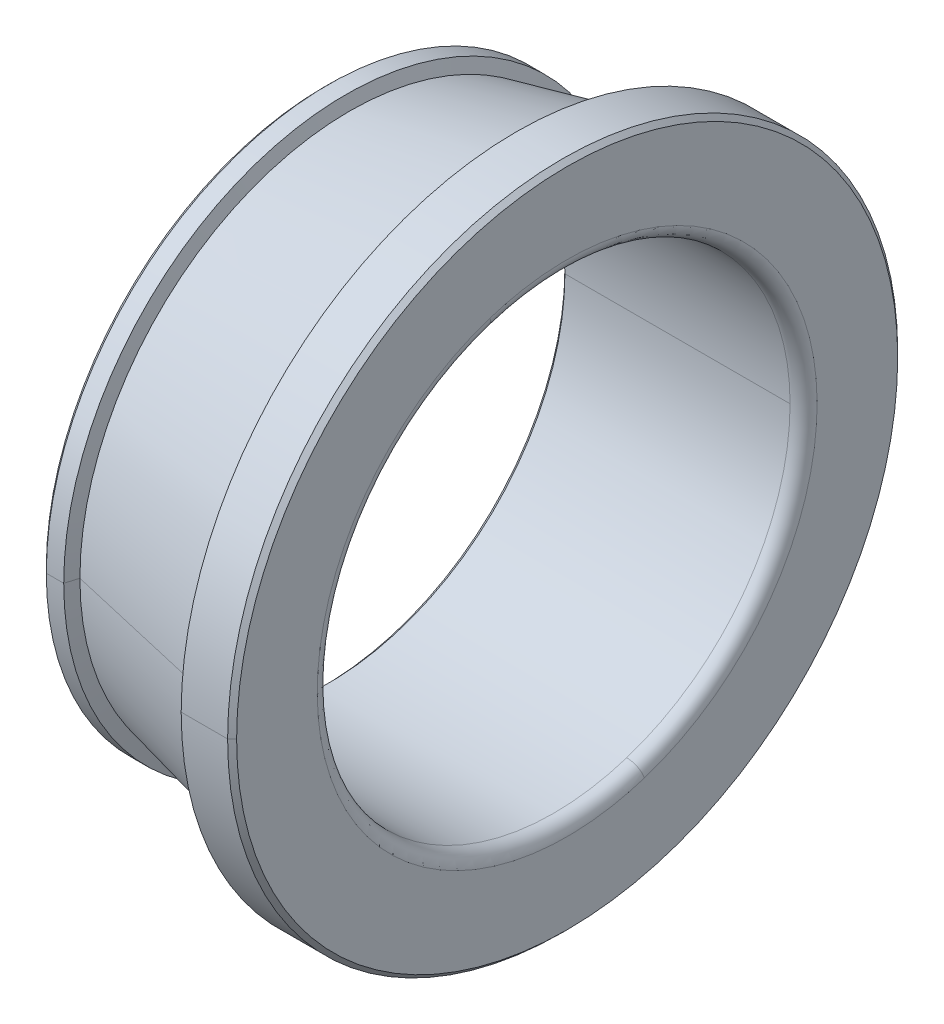
ISO-10303-21;
HEADER;
FILE_DESCRIPTION(('STEP AP214'),'2;1');
FILE_NAME('part.step','',(''),(''),'','','');
FILE_SCHEMA(('AUTOMOTIVE_DESIGN { 1 0 10303 214 1 1 1 1 }'));
ENDSEC;
DATA;
#1=APPLICATION_CONTEXT('core data for automotive mechanical design processes');
#2=APPLICATION_PROTOCOL_DEFINITION('international standard','automotive_design',2000,#1);
#3=PRODUCT_CONTEXT('',#1,'mechanical');
#4=PRODUCT('Part','Part','',(#3));
#5=PRODUCT_RELATED_PRODUCT_CATEGORY('part','',(#4));
#6=PRODUCT_DEFINITION_FORMATION('','',#4);
#7=PRODUCT_DEFINITION_CONTEXT('part definition',#1,'design');
#8=PRODUCT_DEFINITION('design','',#6,#7);
#9=PRODUCT_DEFINITION_SHAPE('','',#8);
#10=(LENGTH_UNIT() NAMED_UNIT(*) SI_UNIT(.MILLI.,.METRE.));
#11=(NAMED_UNIT(*) PLANE_ANGLE_UNIT() SI_UNIT($,.RADIAN.));
#12=(NAMED_UNIT(*) SI_UNIT($,.STERADIAN.) SOLID_ANGLE_UNIT());
#13=UNCERTAINTY_MEASURE_WITH_UNIT(LENGTH_MEASURE(1.E-05),#10,'distance_accuracy_value','');
#14=(GEOMETRIC_REPRESENTATION_CONTEXT(3) GLOBAL_UNCERTAINTY_ASSIGNED_CONTEXT((#13)) GLOBAL_UNIT_ASSIGNED_CONTEXT((#10,
#11,#12)) REPRESENTATION_CONTEXT('',''));
#15=CARTESIAN_POINT('',(0.,0.,0.));
#16=DIRECTION('',(0.,0.,1.));
#17=DIRECTION('',(1.,0.,0.));
#18=AXIS2_PLACEMENT_3D('',#15,#16,#17);
#19=CARTESIAN_POINT('',(0.,20.554666666667,0.));
#20=DIRECTION('',(-1.,0.,0.));
#21=DIRECTION('',(0.,0.,1.));
#22=AXIS2_PLACEMENT_3D('',#19,#20,#21);
#23=PLANE('',#22);
#24=CARTESIAN_POINT('',(0.,0.,0.));
#25=DIRECTION('',(1.,0.,0.));
#26=DIRECTION('',(0.,0.,-1.));
#27=AXIS2_PLACEMENT_3D('',#24,#25,#26);
#28=CIRCLE('',#27,17.833333333333);
#29=CARTESIAN_POINT('',(0.,0.,-17.833333333333));
#30=VERTEX_POINT('',#29);
#31=CARTESIAN_POINT('',(0.,0.,17.833333333333));
#32=VERTEX_POINT('',#31);
#33=EDGE_CURVE('E11',#30,#32,#28,.T.);
#34=ORIENTED_EDGE('',*,*,#33,.T.);
#35=CARTESIAN_POINT('',(0.,0.,0.));
#36=DIRECTION('',(1.,0.,0.));
#37=DIRECTION('',(0.,0.,-1.));
#38=AXIS2_PLACEMENT_3D('',#35,#36,#37);
#39=CIRCLE('',#38,17.833333333333);
#40=EDGE_CURVE('E25',#32,#30,#39,.T.);
#41=ORIENTED_EDGE('',*,*,#40,.T.);
#42=EDGE_LOOP('',(#34,#41));
#43=FACE_BOUND('',#42,.T.);
#44=CARTESIAN_POINT('',(0.,0.,0.));
#45=DIRECTION('',(1.,0.,0.));
#46=DIRECTION('',(0.,0.,-1.));
#47=AXIS2_PLACEMENT_3D('',#44,#45,#46);
#48=CIRCLE('',#47,20.554666666667);
#49=CARTESIAN_POINT('',(0.,0.,20.554666666667));
#50=VERTEX_POINT('',#49);
#51=CARTESIAN_POINT('',(0.,0.,-20.554666666667));
#52=VERTEX_POINT('',#51);
#53=EDGE_CURVE('E371',#50,#52,#48,.T.);
#54=ORIENTED_EDGE('',*,*,#53,.F.);
#55=CARTESIAN_POINT('',(0.,0.,0.));
#56=DIRECTION('',(1.,0.,0.));
#57=DIRECTION('',(0.,0.,-1.));
#58=AXIS2_PLACEMENT_3D('',#55,#56,#57);
#59=CIRCLE('',#58,20.554666666667);
#60=EDGE_CURVE('E366',#52,#50,#59,.T.);
#61=ORIENTED_EDGE('',*,*,#60,.F.);
#62=EDGE_LOOP('',(#54,#61));
#63=FACE_BOUND('',#62,.T.);
#64=ADVANCED_FACE('F17',(#43,#63),#23,.T.);
#65=CARTESIAN_POINT('',(0.333333333333331,0.,0.));
#66=DIRECTION('',(1.,0.,0.));
#67=DIRECTION('',(0.,-1.,0.));
#68=AXIS2_PLACEMENT_3D('',#65,#66,#67);
#69=CONICAL_SURFACE('',#68,20.888,0.785398163396954);
#70=DIRECTION('',(0.707106781186898,0.,0.707106781186197));
#71=VECTOR('',#70,1.);
#72=CARTESIAN_POINT('',(0.,0.,20.554666666667));
#73=LINE('',#72,#71);
#74=CARTESIAN_POINT('',(0.333333333333332,0.,20.888));
#75=VERTEX_POINT('',#74);
#76=EDGE_CURVE('E362',#50,#75,#73,.T.);
#77=ORIENTED_EDGE('',*,*,#76,.T.);
#78=CARTESIAN_POINT('',(0.333333333333331,0.,0.));
#79=DIRECTION('',(1.,0.,0.));
#80=DIRECTION('',(0.,0.,-1.));
#81=AXIS2_PLACEMENT_3D('',#78,#79,#80);
#82=CIRCLE('',#81,20.888);
#83=CARTESIAN_POINT('',(0.333333333333331,0.,-20.888));
#84=VERTEX_POINT('',#83);
#85=EDGE_CURVE('E357',#84,#75,#82,.T.);
#86=ORIENTED_EDGE('',*,*,#85,.F.);
#87=DIRECTION('',(0.707106781186898,0.,-0.707106781186197));
#88=VECTOR('',#87,1.);
#89=CARTESIAN_POINT('',(0.,0.,-20.554666666667));
#90=LINE('',#89,#88);
#91=EDGE_CURVE('E352',#52,#84,#90,.T.);
#92=ORIENTED_EDGE('',*,*,#91,.F.);
#93=ORIENTED_EDGE('',*,*,#60,.T.);
#94=EDGE_LOOP('',(#77,#86,#92,#93));
#95=FACE_BOUND('',#94,.T.);
#96=ADVANCED_FACE('F387',(#95),#69,.T.);
#97=CARTESIAN_POINT('',(0.333333333333331,0.,0.));
#98=DIRECTION('',(1.,0.,0.));
#99=DIRECTION('',(0.,1.,0.));
#100=AXIS2_PLACEMENT_3D('',#97,#98,#99);
#101=CONICAL_SURFACE('',#100,20.888,0.785398163396954);
#102=ORIENTED_EDGE('',*,*,#76,.F.);
#103=ORIENTED_EDGE('',*,*,#53,.T.);
#104=ORIENTED_EDGE('',*,*,#91,.T.);
#105=CARTESIAN_POINT('',(0.333333333333331,0.,0.));
#106=DIRECTION('',(1.,0.,0.));
#107=DIRECTION('',(0.,0.,-1.));
#108=AXIS2_PLACEMENT_3D('',#105,#106,#107);
#109=CIRCLE('',#108,20.888);
#110=EDGE_CURVE('E347',#75,#84,#109,.T.);
#111=ORIENTED_EDGE('',*,*,#110,.F.);
#112=EDGE_LOOP('',(#102,#103,#104,#111));
#113=FACE_BOUND('',#112,.T.);
#114=ADVANCED_FACE('F382',(#113),#101,.T.);
#115=CARTESIAN_POINT('',(18.,0.,0.));
#116=DIRECTION('',(1.,0.,0.));
#117=DIRECTION('',(0.,1.,-2.44532342362417E-13));
#118=AXIS2_PLACEMENT_3D('',#115,#116,#117);
#119=CYLINDRICAL_SURFACE('',#118,20.888);
#120=DIRECTION('',(1.,0.,0.));
#121=VECTOR('',#120,1.);
#122=CARTESIAN_POINT('',(0.333333333333332,0.,20.888));
#123=LINE('',#122,#121);
#124=CARTESIAN_POINT('',(1.6227811681402,0.,20.888));
#125=VERTEX_POINT('',#124);
#126=EDGE_CURVE('E342',#75,#125,#123,.T.);
#127=ORIENTED_EDGE('',*,*,#126,.F.);
#128=ORIENTED_EDGE('',*,*,#110,.T.);
#129=DIRECTION('',(1.,0.,0.));
#130=VECTOR('',#129,1.);
#131=CARTESIAN_POINT('',(0.333333333333332,0.,-20.888));
#132=LINE('',#131,#130);
#133=CARTESIAN_POINT('',(1.6227811681402,0.,-20.888));
#134=VERTEX_POINT('',#133);
#135=EDGE_CURVE('E338',#84,#134,#132,.T.);
#136=ORIENTED_EDGE('',*,*,#135,.T.);
#137=CARTESIAN_POINT('',(1.6227811681402,0.,0.));
#138=DIRECTION('',(1.,0.,0.));
#139=DIRECTION('',(0.,0.,-1.));
#140=AXIS2_PLACEMENT_3D('',#137,#138,#139);
#141=CIRCLE('',#140,20.888);
#142=EDGE_CURVE('E333',#125,#134,#141,.T.);
#143=ORIENTED_EDGE('',*,*,#142,.F.);
#144=EDGE_LOOP('',(#127,#128,#136,#143));
#145=FACE_BOUND('',#144,.T.);
#146=ADVANCED_FACE('F394',(#145),#119,.T.);
#147=CARTESIAN_POINT('',(1.9011701674844,0.,0.));
#148=DIRECTION('',(-1.,0.,0.));
#149=DIRECTION('',(0.,1.,0.));
#150=AXIS2_PLACEMENT_3D('',#147,#148,#149);
#151=CONICAL_SURFACE('',#150,19.967846835473,1.27700505380672);
#152=DIRECTION('',(-0.289583125422376,0.,-0.957152868391778));
#153=VECTOR('',#152,1.);
#154=CARTESIAN_POINT('',(1.9011701674844,0.,-19.967846835473));
#155=LINE('',#154,#153);
#156=CARTESIAN_POINT('',(1.9011701674844,0.,-19.967846835473));
#157=VERTEX_POINT('',#156);
#158=EDGE_CURVE('E328',#157,#134,#155,.T.);
#159=ORIENTED_EDGE('',*,*,#158,.F.);
#160=CARTESIAN_POINT('',(1.9011701674844,0.,0.));
#161=DIRECTION('',(1.,0.,0.));
#162=DIRECTION('',(0.,0.,-1.));
#163=AXIS2_PLACEMENT_3D('',#160,#161,#162);
#164=CIRCLE('',#163,19.967846835473);
#165=CARTESIAN_POINT('',(1.9011701674844,0.,19.967846835473));
#166=VERTEX_POINT('',#165);
#167=EDGE_CURVE('E323',#166,#157,#164,.T.);
#168=ORIENTED_EDGE('',*,*,#167,.F.);
#169=DIRECTION('',(-0.289583125422376,0.,0.957152868391778));
#170=VECTOR('',#169,1.);
#171=CARTESIAN_POINT('',(1.9011701674844,0.,19.967846835473));
#172=LINE('',#171,#170);
#173=EDGE_CURVE('E318',#166,#125,#172,.T.);
#174=ORIENTED_EDGE('',*,*,#173,.T.);
#175=ORIENTED_EDGE('',*,*,#142,.T.);
#176=EDGE_LOOP('',(#159,#168,#174,#175));
#177=FACE_BOUND('',#176,.T.);
#178=ADVANCED_FACE('F396',(#177),#151,.T.);
#179=CARTESIAN_POINT('',(1.9011701674844,0.,0.));
#180=DIRECTION('',(-1.,0.,0.));
#181=DIRECTION('',(0.,-1.,0.));
#182=AXIS2_PLACEMENT_3D('',#179,#180,#181);
#183=CONICAL_SURFACE('',#182,19.967846835473,1.27700505380672);
#184=ORIENTED_EDGE('',*,*,#158,.T.);
#185=CARTESIAN_POINT('',(1.6227811681402,0.,0.));
#186=DIRECTION('',(1.,0.,0.));
#187=DIRECTION('',(0.,0.,-1.));
#188=AXIS2_PLACEMENT_3D('',#185,#186,#187);
#189=CIRCLE('',#188,20.888);
#190=EDGE_CURVE('E313',#134,#125,#189,.T.);
#191=ORIENTED_EDGE('',*,*,#190,.T.);
#192=ORIENTED_EDGE('',*,*,#173,.F.);
#193=CARTESIAN_POINT('',(1.9011701674844,0.,0.));
#194=DIRECTION('',(1.,0.,0.));
#195=DIRECTION('',(0.,0.,-1.));
#196=AXIS2_PLACEMENT_3D('',#193,#194,#195);
#197=CIRCLE('',#196,19.967846835473);
#198=EDGE_CURVE('E308',#157,#166,#197,.T.);
#199=ORIENTED_EDGE('',*,*,#198,.F.);
#200=EDGE_LOOP('',(#184,#191,#192,#199));
#201=FACE_BOUND('',#200,.T.);
#202=ADVANCED_FACE('F401',(#201),#183,.T.);
#203=CARTESIAN_POINT('',(14.791689415647,0.,0.));
#204=DIRECTION('',(1.,0.,0.));
#205=DIRECTION('',(0.,-1.,0.));
#206=AXIS2_PLACEMENT_3D('',#203,#204,#205);
#207=CONICAL_SURFACE('',#206,22.943857696966,0.226892802759296);
#208=DIRECTION('',(0.974370064785228,0.,0.224951054343897));
#209=VECTOR('',#208,1.);
#210=CARTESIAN_POINT('',(1.9011701674844,0.,19.967846835473));
#211=LINE('',#210,#209);
#212=CARTESIAN_POINT('',(14.791689415647,0.,22.943857696966));
#213=VERTEX_POINT('',#212);
#214=EDGE_CURVE('E304',#166,#213,#211,.T.);
#215=ORIENTED_EDGE('',*,*,#214,.T.);
#216=CARTESIAN_POINT('',(14.791689415647,0.,0.));
#217=DIRECTION('',(1.,0.,0.));
#218=DIRECTION('',(0.,0.,-1.));
#219=AXIS2_PLACEMENT_3D('',#216,#217,#218);
#220=CIRCLE('',#219,22.943857696966);
#221=CARTESIAN_POINT('',(14.791689415647,0.,-22.943857696966));
#222=VERTEX_POINT('',#221);
#223=EDGE_CURVE('E299',#222,#213,#220,.T.);
#224=ORIENTED_EDGE('',*,*,#223,.F.);
#225=DIRECTION('',(0.974370064785228,0.,-0.224951054343897));
#226=VECTOR('',#225,1.);
#227=CARTESIAN_POINT('',(1.9011701674844,0.,-19.967846835473));
#228=LINE('',#227,#226);
#229=EDGE_CURVE('E294',#157,#222,#228,.T.);
#230=ORIENTED_EDGE('',*,*,#229,.F.);
#231=ORIENTED_EDGE('',*,*,#198,.T.);
#232=EDGE_LOOP('',(#215,#224,#230,#231));
#233=FACE_BOUND('',#232,.T.);
#234=ADVANCED_FACE('F408',(#233),#207,.T.);
#235=CARTESIAN_POINT('',(14.791689415647,0.,0.));
#236=DIRECTION('',(1.,0.,0.));
#237=DIRECTION('',(0.,1.,0.));
#238=AXIS2_PLACEMENT_3D('',#235,#236,#237);
#239=CONICAL_SURFACE('',#238,22.943857696966,0.226892802759296);
#240=ORIENTED_EDGE('',*,*,#214,.F.);
#241=ORIENTED_EDGE('',*,*,#167,.T.);
#242=ORIENTED_EDGE('',*,*,#229,.T.);
#243=CARTESIAN_POINT('',(14.791689415647,0.,0.));
#244=DIRECTION('',(1.,0.,0.));
#245=DIRECTION('',(0.,0.,-1.));
#246=AXIS2_PLACEMENT_3D('',#243,#244,#245);
#247=CIRCLE('',#246,22.943857696966);
#248=EDGE_CURVE('E289',#213,#222,#247,.T.);
#249=ORIENTED_EDGE('',*,*,#248,.F.);
#250=EDGE_LOOP('',(#240,#241,#242,#249));
#251=FACE_BOUND('',#250,.T.);
#252=ADVANCED_FACE('F405',(#251),#239,.T.);
#253=CARTESIAN_POINT('',(14.230120300523,0.,0.));
#254=DIRECTION('',(-1.,0.,0.));
#255=DIRECTION('',(0.,1.,0.));
#256=AXIS2_PLACEMENT_3D('',#253,#254,#255);
#257=CONICAL_SURFACE('',#256,24.8,1.27700505380678);
#258=DIRECTION('',(-0.289583125422325,0.,-0.957152868391793));
#259=VECTOR('',#258,1.);
#260=CARTESIAN_POINT('',(14.791689415647,0.,-22.943857696966));
#261=LINE('',#260,#259);
#262=CARTESIAN_POINT('',(14.230120300523,0.,-24.8));
#263=VERTEX_POINT('',#262);
#264=EDGE_CURVE('E285',#222,#263,#261,.T.);
#265=ORIENTED_EDGE('',*,*,#264,.T.);
#266=CARTESIAN_POINT('',(14.230120300523,0.,0.));
#267=DIRECTION('',(1.,0.,0.));
#268=DIRECTION('',(0.,0.,-1.));
#269=AXIS2_PLACEMENT_3D('',#266,#267,#268);
#270=CIRCLE('',#269,24.8);
#271=CARTESIAN_POINT('',(14.230120300523,0.,24.8));
#272=VERTEX_POINT('',#271);
#273=EDGE_CURVE('E280',#272,#263,#270,.T.);
#274=ORIENTED_EDGE('',*,*,#273,.F.);
#275=DIRECTION('',(-0.289583125422325,0.,0.957152868391794));
#276=VECTOR('',#275,1.);
#277=CARTESIAN_POINT('',(14.791689415647,0.,22.943857696966));
#278=LINE('',#277,#276);
#279=EDGE_CURVE('E275',#213,#272,#278,.T.);
#280=ORIENTED_EDGE('',*,*,#279,.F.);
#281=ORIENTED_EDGE('',*,*,#248,.T.);
#282=EDGE_LOOP('',(#265,#274,#280,#281));
#283=FACE_BOUND('',#282,.T.);
#284=ADVANCED_FACE('F410',(#283),#257,.F.);
#285=CARTESIAN_POINT('',(14.230120300523,0.,0.));
#286=DIRECTION('',(-1.,0.,0.));
#287=DIRECTION('',(0.,-1.,0.));
#288=AXIS2_PLACEMENT_3D('',#285,#286,#287);
#289=CONICAL_SURFACE('',#288,24.8,1.27700505380678);
#290=ORIENTED_EDGE('',*,*,#264,.F.);
#291=ORIENTED_EDGE('',*,*,#223,.T.);
#292=ORIENTED_EDGE('',*,*,#279,.T.);
#293=CARTESIAN_POINT('',(14.230120300523,0.,0.));
#294=DIRECTION('',(1.,0.,0.));
#295=DIRECTION('',(0.,0.,-1.));
#296=AXIS2_PLACEMENT_3D('',#293,#294,#295);
#297=CIRCLE('',#296,24.8);
#298=EDGE_CURVE('E270',#263,#272,#297,.T.);
#299=ORIENTED_EDGE('',*,*,#298,.F.);
#300=EDGE_LOOP('',(#290,#291,#292,#299));
#301=FACE_BOUND('',#300,.T.);
#302=ADVANCED_FACE('F415',(#301),#289,.F.);
#303=CARTESIAN_POINT('',(18.,0.,0.));
#304=DIRECTION('',(1.,0.,0.));
#305=DIRECTION('',(0.,-1.,-1.13526025456648E-13));
#306=AXIS2_PLACEMENT_3D('',#303,#304,#305);
#307=CYLINDRICAL_SURFACE('',#306,24.8);
#308=DIRECTION('',(1.,0.,0.));
#309=VECTOR('',#308,1.);
#310=CARTESIAN_POINT('',(14.230120300523,0.,24.8));
#311=LINE('',#310,#309);
#312=CARTESIAN_POINT('',(17.666666666667,0.,24.8));
#313=VERTEX_POINT('',#312);
#314=EDGE_CURVE('E266',#272,#313,#311,.T.);
#315=ORIENTED_EDGE('',*,*,#314,.T.);
#316=CARTESIAN_POINT('',(17.666666666667,0.,0.));
#317=DIRECTION('',(1.,0.,0.));
#318=DIRECTION('',(0.,0.,-1.));
#319=AXIS2_PLACEMENT_3D('',#316,#317,#318);
#320=CIRCLE('',#319,24.8);
#321=CARTESIAN_POINT('',(17.666666666667,0.,-24.8));
#322=VERTEX_POINT('',#321);
#323=EDGE_CURVE('E261',#322,#313,#320,.T.);
#324=ORIENTED_EDGE('',*,*,#323,.F.);
#325=DIRECTION('',(1.,0.,0.));
#326=VECTOR('',#325,1.);
#327=CARTESIAN_POINT('',(14.230120300523,0.,-24.8));
#328=LINE('',#327,#326);
#329=EDGE_CURVE('E256',#263,#322,#328,.T.);
#330=ORIENTED_EDGE('',*,*,#329,.F.);
#331=ORIENTED_EDGE('',*,*,#298,.T.);
#332=EDGE_LOOP('',(#315,#324,#330,#331));
#333=FACE_BOUND('',#332,.T.);
#334=ADVANCED_FACE('F421',(#333),#307,.T.);
#335=CARTESIAN_POINT('',(18.,0.,0.));
#336=DIRECTION('',(1.,0.,0.));
#337=DIRECTION('',(0.,1.,-1.13526025456648E-13));
#338=AXIS2_PLACEMENT_3D('',#335,#336,#337);
#339=CYLINDRICAL_SURFACE('',#338,24.8);
#340=ORIENTED_EDGE('',*,*,#314,.F.);
#341=ORIENTED_EDGE('',*,*,#273,.T.);
#342=ORIENTED_EDGE('',*,*,#329,.T.);
#343=CARTESIAN_POINT('',(17.666666666667,0.,0.));
#344=DIRECTION('',(1.,0.,0.));
#345=DIRECTION('',(0.,0.,-1.));
#346=AXIS2_PLACEMENT_3D('',#343,#344,#345);
#347=CIRCLE('',#346,24.8);
#348=EDGE_CURVE('E251',#313,#322,#347,.T.);
#349=ORIENTED_EDGE('',*,*,#348,.F.);
#350=EDGE_LOOP('',(#340,#341,#342,#349));
#351=FACE_BOUND('',#350,.T.);
#352=ADVANCED_FACE('F419',(#351),#339,.T.);
#353=CARTESIAN_POINT('',(18.,0.,0.));
#354=DIRECTION('',(-1.,0.,0.));
#355=DIRECTION('',(0.,1.,0.));
#356=AXIS2_PLACEMENT_3D('',#353,#354,#355);
#357=CONICAL_SURFACE('',#356,24.466666666667,0.785398163397443);
#358=DIRECTION('',(-0.707106781186551,0.,-0.707106781186544));
#359=VECTOR('',#358,1.);
#360=CARTESIAN_POINT('',(18.,0.,-24.466666666667));
#361=LINE('',#360,#359);
#362=CARTESIAN_POINT('',(18.,0.,-24.466666666667));
#363=VERTEX_POINT('',#362);
#364=EDGE_CURVE('E246',#363,#322,#361,.T.);
#365=ORIENTED_EDGE('',*,*,#364,.F.);
#366=CARTESIAN_POINT('',(18.,0.,0.));
#367=DIRECTION('',(1.,0.,0.));
#368=DIRECTION('',(0.,0.,-1.));
#369=AXIS2_PLACEMENT_3D('',#366,#367,#368);
#370=CIRCLE('',#369,24.466666666667);
#371=CARTESIAN_POINT('',(18.,0.,24.466666666667));
#372=VERTEX_POINT('',#371);
#373=EDGE_CURVE('E241',#372,#363,#370,.T.);
#374=ORIENTED_EDGE('',*,*,#373,.F.);
#375=DIRECTION('',(-0.707106781186551,0.,0.707106781186544));
#376=VECTOR('',#375,1.);
#377=CARTESIAN_POINT('',(18.,0.,24.466666666667));
#378=LINE('',#377,#376);
#379=EDGE_CURVE('E236',#372,#313,#378,.T.);
#380=ORIENTED_EDGE('',*,*,#379,.T.);
#381=ORIENTED_EDGE('',*,*,#348,.T.);
#382=EDGE_LOOP('',(#365,#374,#380,#381));
#383=FACE_BOUND('',#382,.T.);
#384=ADVANCED_FACE('F427',(#383),#357,.T.);
#385=CARTESIAN_POINT('',(18.,0.,0.));
#386=DIRECTION('',(-1.,0.,0.));
#387=DIRECTION('',(0.,-1.,0.));
#388=AXIS2_PLACEMENT_3D('',#385,#386,#387);
#389=CONICAL_SURFACE('',#388,24.466666666667,0.785398163397443);
#390=ORIENTED_EDGE('',*,*,#364,.T.);
#391=ORIENTED_EDGE('',*,*,#323,.T.);
#392=ORIENTED_EDGE('',*,*,#379,.F.);
#393=CARTESIAN_POINT('',(18.,0.,0.));
#394=DIRECTION('',(1.,0.,0.));
#395=DIRECTION('',(0.,0.,-1.));
#396=AXIS2_PLACEMENT_3D('',#393,#394,#395);
#397=CIRCLE('',#396,24.466666666667);
#398=EDGE_CURVE('E233',#363,#372,#397,.T.);
#399=ORIENTED_EDGE('',*,*,#398,.F.);
#400=EDGE_LOOP('',(#390,#391,#392,#399));
#401=FACE_BOUND('',#400,.T.);
#402=ADVANCED_FACE('F424',(#401),#389,.T.);
#403=CARTESIAN_POINT('',(18.,18.5,0.));
#404=DIRECTION('',(1.,0.,0.));
#405=DIRECTION('',(0.,0.,-1.));
#406=AXIS2_PLACEMENT_3D('',#403,#404,#405);
#407=PLANE('',#406);
#408=ORIENTED_EDGE('',*,*,#398,.T.);
#409=ORIENTED_EDGE('',*,*,#373,.T.);
#410=EDGE_LOOP('',(#408,#409));
#411=FACE_BOUND('',#410,.T.);
#412=CARTESIAN_POINT('',(18.,-17.5945455514589,-5.71681439593608));
#413=CARTESIAN_POINT('',(18.,-17.5010104070531,-6.00470674927417));
#414=CARTESIAN_POINT('',(18.,-17.4003975495641,-6.29029883973323));
#415=CARTESIAN_POINT('',(18.,-17.1852851780798,-6.85620450764111));
#416=CARTESIAN_POINT('',(18.,-17.0707856640843,-7.13651808508993));
#417=CARTESIAN_POINT('',(18.,-16.8281687492468,-7.6911887397251));
#418=CARTESIAN_POINT('',(18.,-16.7000513484047,-7.96554581691146));
#419=CARTESIAN_POINT('',(18.,-16.4305092002342,-8.50764324084954));
#420=CARTESIAN_POINT('',(18.,-16.2890844529059,-8.77538358760126));
#421=CARTESIAN_POINT('',(18.,-15.9932678087849,-9.3036023477846));
#422=CARTESIAN_POINT('',(18.,-15.8388759119924,-9.56408076121622));
#423=CARTESIAN_POINT('',(18.,-15.5174970485517,-10.077148191144));
#424=CARTESIAN_POINT('',(18.,-15.3505100819035,-10.3297372076402));
#425=CARTESIAN_POINT('',(18.,-15.0043433285379,-10.8264173207797));
#426=CARTESIAN_POINT('',(18.,-14.8251635418205,-11.0705084174231));
#427=CARTESIAN_POINT('',(18.,-14.4550428178815,-11.5496046577372));
#428=CARTESIAN_POINT('',(18.,-14.26410188066,-11.7846098014079));
#429=CARTESIAN_POINT('',(18.,-13.8709188465388,-12.2449679868069));
#430=CARTESIAN_POINT('',(18.,-13.668676749639,-12.4703210285352));
#431=CARTESIAN_POINT('',(18.,-13.253378615788,-12.9108321150998));
#432=CARTESIAN_POINT('',(18.,-13.0403225788368,-13.1259901599361));
#433=CARTESIAN_POINT('',(18.,-12.6039098353496,-13.5455929180697));
#434=CARTESIAN_POINT('',(18.,-12.3805531288136,-13.7500376313669));
#435=CARTESIAN_POINT('',(18.,-11.9240771320769,-14.1477212012199));
#436=CARTESIAN_POINT('',(18.,-11.6909578418762,-14.3409600577757));
#437=CARTESIAN_POINT('',(18.,-11.2155182825857,-14.7157663848094));
#438=CARTESIAN_POINT('',(18.,-10.9731980134958,-14.8973338552874));
#439=CARTESIAN_POINT('',(18.,-10.4799402671834,-15.2483599982272));
#440=CARTESIAN_POINT('',(18.,-10.2290027899609,-15.4178186706889));
#441=CARTESIAN_POINT('',(18.,-9.71911515774443,-15.7442189768111));
#442=CARTESIAN_POINT('',(18.,-9.46016500275049,-15.9011606104715));
#443=CARTESIAN_POINT('',(18.,-8.93487584859616,-16.202148752849));
#444=CARTESIAN_POINT('',(18.,-8.66853684943578,-16.3461952615661));
#445=CARTESIAN_POINT('',(18.,-8.12911164092603,-16.6210461334007));
#446=CARTESIAN_POINT('',(18.,-7.85602543157665,-16.7518504965181));
#447=CARTESIAN_POINT('',(18.,-7.30376369128679,-16.9999019579854));
#448=CARTESIAN_POINT('',(18.,-7.02458816034629,-17.1171490563352));
#449=CARTESIAN_POINT('',(18.,-6.4608203351811,-17.3378035297377));
#450=CARTESIAN_POINT('',(18.,-6.17622804095641,-17.4412109047903));
#451=CARTESIAN_POINT('',(18.,-5.60231229698694,-17.6339368141746));
#452=CARTESIAN_POINT('',(18.,-5.31298884724217,-17.7232553485062));
#453=CARTESIAN_POINT('',(18.,-4.73030779776474,-17.8875884002758));
#454=CARTESIAN_POINT('',(18.,-4.43695019803207,-17.9626029177137));
#455=CARTESIAN_POINT('',(18.,-3.84690757273169,-18.0981472191529));
#456=CARTESIAN_POINT('',(18.,-3.55022254716397,-18.1586770031542));
#457=CARTESIAN_POINT('',(18.,-2.95423981040662,-18.2651060161687));
#458=CARTESIAN_POINT('',(18.,-2.65494209921698,-18.3110052451819));
#459=CARTESIAN_POINT('',(18.,-2.05445502561743,-18.3880625729572));
#460=CARTESIAN_POINT('',(18.,-1.75326566320751,-18.4192206717193));
#461=CARTESIAN_POINT('',(18.,-1.14972087872252,-18.4667206764034));
#462=CARTESIAN_POINT('',(18.,-0.847365456647439,-18.4830625823253));
#463=CARTESIAN_POINT('',(18.,-0.242216953527111,-18.5008908322464));
#464=CARTESIAN_POINT('',(18.,0.0605761275181368,-18.5023771762455));
#465=CARTESIAN_POINT('',(18.,0.665870493525034,-18.4904907215879));
#466=CARTESIAN_POINT('',(18.,0.968371778486683,-18.4771179229312));
#467=CARTESIAN_POINT('',(18.,1.57235380023492,-18.4355453992053));
#468=CARTESIAN_POINT('',(18.,1.8738345370215,-18.4073456741362));
#469=CARTESIAN_POINT('',(18.,2.4750491689181,-18.336187233193));
#470=CARTESIAN_POINT('',(18.,2.77478306402811,-18.2932285173191));
#471=CARTESIAN_POINT('',(18.,3.37178192736466,-18.1926555860757));
#472=CARTESIAN_POINT('',(18.,3.66904689559119,-18.1350413707062));
#473=CARTESIAN_POINT('',(18.,4.26039176781499,-18.005296238163));
#474=CARTESIAN_POINT('',(18.,4.55447167181224,-17.9331653209893));
#475=CARTESIAN_POINT('',(18.,5.1387379513304,-17.774560554535));
#476=CARTESIAN_POINT('',(18.,5.42892432685129,-17.6880867052544));
#477=CARTESIAN_POINT('',(18.,6.00470446502077,-17.5010043976634));
#478=CARTESIAN_POINT('',(18.,6.29029822766934,-17.400395939353));
#479=CARTESIAN_POINT('',(18.,6.85620511970491,-17.1852867882909));
#480=CARTESIAN_POINT('',(18.,7.13651824909189,-17.0707860955391));
#481=CARTESIAN_POINT('',(18.,7.69118857572304,-16.8281683177921));
#482=CARTESIAN_POINT('',(18.,7.96554577296721,-16.7000512327968));
#483=CARTESIAN_POINT('',(18.,8.5076432847937,-16.4305093158422));
#484=CARTESIAN_POINT('',(18.,8.77538359937603,-16.2890844838829));
#485=CARTESIAN_POINT('',(18.,9.30360233600975,-15.9932677778079));
#486=CARTESIAN_POINT('',(18.,9.56408075806113,-15.8388759036921));
#487=CARTESIAN_POINT('',(18.,10.077148194299,-15.517497056852));
#488=CARTESIAN_POINT('',(18.,10.3297372084855,-15.3505100841276));
#489=CARTESIAN_POINT('',(18.,10.8264173199343,-15.0043433263139));
#490=CARTESIAN_POINT('',(18.,11.0705084171966,-14.8251635412245));
#491=CARTESIAN_POINT('',(18.,11.5496046579637,-14.4550428184775));
#492=CARTESIAN_POINT('',(18.,11.7846098014686,-14.2641018808197));
#493=CARTESIAN_POINT('',(18.,12.2449679867462,-13.8709188463791));
#494=CARTESIAN_POINT('',(18.,12.4703210285189,-13.6686767495962));
#495=CARTESIAN_POINT('',(18.,12.910832115116,-13.2533786158308));
#496=CARTESIAN_POINT('',(18.,13.1259901599404,-13.0403225788483));
#497=CARTESIAN_POINT('',(18.,13.5455929180653,-12.6039098353381));
#498=CARTESIAN_POINT('',(18.,13.7500376313657,-12.3805531288105));
#499=CARTESIAN_POINT('',(18.,14.1477212012211,-11.92407713208));
#500=CARTESIAN_POINT('',(18.,14.340960057776,-11.6909578418771));
#501=CARTESIAN_POINT('',(18.,14.7157663848091,-11.2155182825849));
#502=CARTESIAN_POINT('',(18.,14.8973338552873,-10.9731980134956));
#503=CARTESIAN_POINT('',(18.,15.2483599982272,-10.4799402671837));
#504=CARTESIAN_POINT('',(18.,15.4178186706889,-10.229002789961));
#505=CARTESIAN_POINT('',(18.,15.744218976811,-9.71911515774443));
#506=CARTESIAN_POINT('',(18.,15.9011606104714,-9.46016500275053));
#507=CARTESIAN_POINT('',(18.,16.202148752849,-8.93487584859623));
#508=CARTESIAN_POINT('',(18.,16.3461952615661,-8.66853684943584));
#509=CARTESIAN_POINT('',(18.,16.6210461334007,-8.12911164092607));
#510=CARTESIAN_POINT('',(18.,16.7518504965181,-7.85602543157671));
#511=CARTESIAN_POINT('',(18.,16.9999019579854,-7.30376369128683));
#512=CARTESIAN_POINT('',(18.,17.1171490563352,-7.02458816034633));
#513=CARTESIAN_POINT('',(18.,17.3378035297376,-6.46082033518117));
#514=CARTESIAN_POINT('',(18.,17.4412109047901,-6.17622804095652));
#515=CARTESIAN_POINT('',(18.,17.6339368141748,-5.60231229698693));
#516=CARTESIAN_POINT('',(18.,17.723255348507,-5.31298884724199));
#517=CARTESIAN_POINT('',(18.,17.8875884002749,-4.73030779776502));
#518=CARTESIAN_POINT('',(18.,17.9626029177105,-4.43695019803298));
#519=CARTESIAN_POINT('',(18.,18.0981472191561,-3.84690757273087));
#520=CARTESIAN_POINT('',(18.,18.1586770031661,-3.55022254716081));
#521=CARTESIAN_POINT('',(18.,18.2651060161569,-2.95423981040988));
#522=CARTESIAN_POINT('',(18.,18.3110052451377,-2.65494209922902));
#523=CARTESIAN_POINT('',(18.,18.3880625730014,-2.05445502560549));
#524=CARTESIAN_POINT('',(18.,18.4192206718841,-1.75326566316281));
#525=CARTESIAN_POINT('',(18.,18.4667206762385,-1.14972087876733));
#526=CARTESIAN_POINT('',(18.,18.4830625817101,-0.847365456814522));
#527=CARTESIAN_POINT('',(18.,18.5008908328616,-0.242216953360156));
#528=CARTESIAN_POINT('',(18.,18.5023771785417,0.0605761281414022));
#529=CARTESIAN_POINT('',(18.,18.4904907192916,0.665870492901645));
#530=CARTESIAN_POINT('',(18.,18.4771179143616,0.968371776160329));
#531=CARTESIAN_POINT('',(18.,18.4355454077749,1.57235380256115));
#532=CARTESIAN_POINT('',(18.,18.4073457061182,1.87383454570328));
#533=CARTESIAN_POINT('',(18.,18.336187201211,2.47504916023622));
#534=CARTESIAN_POINT('',(18.,18.2932283979605,2.77478303162703));
#535=CARTESIAN_POINT('',(18.,18.1926557054343,3.37178195976566));
#536=CARTESIAN_POINT('',(18.,18.1350418161584,3.66904701651348));
#537=CARTESIAN_POINT('',(18.,18.0052957927108,4.2603916468926));
#538=CARTESIAN_POINT('',(18.,17.9331636585391,4.5544712205239));
#539=CARTESIAN_POINT('',(18.,17.7745622169852,5.13873840261865));
#540=CARTESIAN_POINT('',(18.,17.6880929096032,5.4289260110821));
#541=CARTESIAN_POINT('',(18.,17.5945455514589,5.71681439593598));
#542=B_SPLINE_CURVE_WITH_KNOTS('',3,(#412,#413,#414,#415,#416,#417,#418,#419,#420,#421,#422,
#423,#424,#425,#426,#427,#428,#429,#430,#431,#432,#433,#434,#435,#436,#437,#438,#439,#440,#441,
#442,#443,#444,#445,#446,#447,#448,#449,#450,#451,#452,#453,#454,#455,#456,#457,#458,#459,#460,
#461,#462,#463,#464,#465,#466,#467,#468,#469,#470,#471,#472,#473,#474,#475,#476,#477,#478,#479,
#480,#481,#482,#483,#484,#485,#486,#487,#488,#489,#490,#491,#492,#493,#494,#495,#496,#497,#498,
#499,#500,#501,#502,#503,#504,#505,#506,#507,#508,#509,#510,#511,#512,#513,#514,#515,#516,#517,
#518,#519,#520,#521,#522,#523,#524,#525,#526,#527,#528,#529,#530,#531,#532,#533,#534,#535,#536,
#537,#538,#539,#540,#541),.UNSPECIFIED.,.F.,.F.,(4,2,2,2,2,2,2,2,2,2,2,2,2,2,2,2,2,2,2,2,2,2,2,
2,2,2,2,2,2,2,2,2,2,2,2,2,2,2,2,2,2,2,2,2,2,2,2,2,2,2,2,2,2,2,2,2,2,2,2,2,2,2,2,2,4),(0.,
0.908025455347676,1.81605091069536,2.72407636604303,3.63210182139071,4.54012727673838,
5.44815273208606,6.35617818743374,7.26420364278142,8.17222909812909,9.08025455347677,
9.98828000882444,10.8963054641721,11.8043309195198,12.7123563748675,13.6203818302152,
14.5284072855628,15.4364327409105,16.3444581962582,17.2524836516059,18.1605091069535,
19.0685345623012,19.9765600176489,20.8845854729966,21.7926109283442,22.7006363836919,
23.6086618390396,24.5166872943873,25.424712749735,26.3327382050826,27.2407636604303,
28.148789115778,29.0568145711257,29.9648400264733,30.872865481821,31.7808909371687,
32.6889163925164,33.596941847864,34.5049673032117,35.4129927585594,36.3210182139071,
37.2290436692548,38.1370691246024,39.0450945799501,39.9531200352978,40.8611454906455,
41.7691709459931,42.6771964013408,43.5852218566885,44.4932473120362,45.4012727673839,
46.3092982227315,47.2173236780792,48.1253491334269,49.0333745887746,49.9414000441222,
50.8494254994699,51.7574509548176,52.6654764101653,53.5735018655129,54.4815273208606,
55.3895527762083,56.297578231556,57.2056036869037,58.1136291422513),.UNSPECIFIED.);
#543=CARTESIAN_POINT('',(18.,-17.5945455514589,-5.71681439593605));
#544=VERTEX_POINT('',#543);
#545=CARTESIAN_POINT('',(18.,17.5945455514589,5.71681439593605));
#546=VERTEX_POINT('',#545);
#547=EDGE_CURVE('E232',#544,#546,#542,.T.);
#548=ORIENTED_EDGE('',*,*,#547,.F.);
#549=CARTESIAN_POINT('',(18.,17.5945455514589,5.71681439593608));
#550=CARTESIAN_POINT('',(18.,17.5010104070531,6.00470674927417));
#551=CARTESIAN_POINT('',(18.,17.4003975495641,6.29029883973324));
#552=CARTESIAN_POINT('',(18.,17.1852851780798,6.85620450764112));
#553=CARTESIAN_POINT('',(18.,17.0707856640843,7.13651808508993));
#554=CARTESIAN_POINT('',(18.,16.8281687492468,7.6911887397251));
#555=CARTESIAN_POINT('',(18.,16.7000513484047,7.96554581691146));
#556=CARTESIAN_POINT('',(18.,16.4305092002342,8.50764324084954));
#557=CARTESIAN_POINT('',(18.,16.2890844529059,8.77538358760126));
#558=CARTESIAN_POINT('',(18.,15.9932678087849,9.30360234778461));
#559=CARTESIAN_POINT('',(18.,15.8388759119924,9.56408076121623));
#560=CARTESIAN_POINT('',(18.,15.5174970485517,10.077148191144));
#561=CARTESIAN_POINT('',(18.,15.3505100819035,10.3297372076402));
#562=CARTESIAN_POINT('',(18.,15.0043433285379,10.8264173207797));
#563=CARTESIAN_POINT('',(18.,14.8251635418204,11.0705084174231));
#564=CARTESIAN_POINT('',(18.,14.4550428178815,11.5496046577372));
#565=CARTESIAN_POINT('',(18.,14.26410188066,11.7846098014079));
#566=CARTESIAN_POINT('',(18.,13.8709188465387,12.2449679868069));
#567=CARTESIAN_POINT('',(18.,13.668676749639,12.4703210285352));
#568=CARTESIAN_POINT('',(18.,13.253378615788,12.9108321150998));
#569=CARTESIAN_POINT('',(18.,13.0403225788368,13.1259901599361));
#570=CARTESIAN_POINT('',(18.,12.6039098353496,13.5455929180697));
#571=CARTESIAN_POINT('',(18.,12.3805531288136,13.7500376313669));
#572=CARTESIAN_POINT('',(18.,11.9240771320769,14.1477212012199));
#573=CARTESIAN_POINT('',(18.,11.6909578418762,14.3409600577757));
#574=CARTESIAN_POINT('',(18.,11.2155182825857,14.7157663848095));
#575=CARTESIAN_POINT('',(18.,10.9731980134958,14.8973338552874));
#576=CARTESIAN_POINT('',(18.,10.4799402671834,15.2483599982272));
#577=CARTESIAN_POINT('',(18.,10.2290027899609,15.4178186706889));
#578=CARTESIAN_POINT('',(18.,9.71911515774442,15.7442189768111));
#579=CARTESIAN_POINT('',(18.,9.46016500275048,15.9011606104715));
#580=CARTESIAN_POINT('',(18.,8.93487584859616,16.202148752849));
#581=CARTESIAN_POINT('',(18.,8.66853684943577,16.3461952615661));
#582=CARTESIAN_POINT('',(18.,8.12911164092602,16.6210461334007));
#583=CARTESIAN_POINT('',(18.,7.85602543157665,16.7518504965181));
#584=CARTESIAN_POINT('',(18.,7.30376369128678,16.9999019579854));
#585=CARTESIAN_POINT('',(18.,7.02458816034628,17.1171490563352));
#586=CARTESIAN_POINT('',(18.,6.46082033518109,17.3378035297377));
#587=CARTESIAN_POINT('',(18.,6.17622804095639,17.4412109047903));
#588=CARTESIAN_POINT('',(18.,5.60231229698693,17.6339368141746));
#589=CARTESIAN_POINT('',(18.,5.31298884724216,17.7232553485062));
#590=CARTESIAN_POINT('',(18.,4.73030779776472,17.8875884002758));
#591=CARTESIAN_POINT('',(18.,4.43695019803205,17.9626029177137));
#592=CARTESIAN_POINT('',(18.,3.84690757273166,18.0981472191529));
#593=CARTESIAN_POINT('',(18.,3.55022254716394,18.1586770031542));
#594=CARTESIAN_POINT('',(18.,2.95423981040658,18.2651060161687));
#595=CARTESIAN_POINT('',(18.,2.65494209921695,18.3110052451819));
#596=CARTESIAN_POINT('',(18.,2.0544550256174,18.3880625729572));
#597=CARTESIAN_POINT('',(18.,1.75326566320748,18.4192206717193));
#598=CARTESIAN_POINT('',(18.,1.14972087872249,18.4667206764034));
#599=CARTESIAN_POINT('',(18.,0.847365456647418,18.4830625823253));
#600=CARTESIAN_POINT('',(18.,0.242216953527091,18.5008908322464));
#601=CARTESIAN_POINT('',(18.,-0.0605761275181597,18.5023771762455));
#602=CARTESIAN_POINT('',(18.,-0.665870493525057,18.4904907215879));
#603=CARTESIAN_POINT('',(18.,-0.968371778486704,18.4771179229312));
#604=CARTESIAN_POINT('',(18.,-1.57235380023494,18.4355453992053));
#605=CARTESIAN_POINT('',(18.,-1.87383453702152,18.4073456741362));
#606=CARTESIAN_POINT('',(18.,-2.47504916891812,18.336187233193));
#607=CARTESIAN_POINT('',(18.,-2.77478306402814,18.2932285173191));
#608=CARTESIAN_POINT('',(18.,-3.37178192736469,18.1926555860757));
#609=CARTESIAN_POINT('',(18.,-3.66904689559122,18.1350413707062));
#610=CARTESIAN_POINT('',(18.,-4.26039176781502,18.005296238163));
#611=CARTESIAN_POINT('',(18.,-4.55447167181228,17.9331653209893));
#612=CARTESIAN_POINT('',(18.,-5.13873795133043,17.774560554535));
#613=CARTESIAN_POINT('',(18.,-5.42892432685132,17.6880867052543));
#614=CARTESIAN_POINT('',(18.,-6.00470446502079,17.5010043976634));
#615=CARTESIAN_POINT('',(18.,-6.29029822766937,17.400395939353));
#616=CARTESIAN_POINT('',(18.,-6.85620511970494,17.1852867882909));
#617=CARTESIAN_POINT('',(18.,-7.13651824909192,17.0707860955391));
#618=CARTESIAN_POINT('',(18.,-7.69118857572307,16.8281683177921));
#619=CARTESIAN_POINT('',(18.,-7.96554577296723,16.7000512327968));
#620=CARTESIAN_POINT('',(18.,-8.50764328479372,16.4305093158422));
#621=CARTESIAN_POINT('',(18.,-8.77538359937605,16.2890844838829));
#622=CARTESIAN_POINT('',(18.,-9.30360233600977,15.9932677778079));
#623=CARTESIAN_POINT('',(18.,-9.56408075806115,15.8388759036921));
#624=CARTESIAN_POINT('',(18.,-10.077148194299,15.517497056852));
#625=CARTESIAN_POINT('',(18.,-10.3297372084856,15.3505100841276));
#626=CARTESIAN_POINT('',(18.,-10.8264173199343,15.0043433263139));
#627=CARTESIAN_POINT('',(18.,-11.0705084171966,14.8251635412245));
#628=CARTESIAN_POINT('',(18.,-11.5496046579637,14.4550428184774));
#629=CARTESIAN_POINT('',(18.,-11.7846098014686,14.2641018808197));
#630=CARTESIAN_POINT('',(18.,-12.2449679867462,13.8709188463791));
#631=CARTESIAN_POINT('',(18.,-12.4703210285189,13.6686767495962));
#632=CARTESIAN_POINT('',(18.,-12.9108321151161,13.2533786158308));
#633=CARTESIAN_POINT('',(18.,-13.1259901599405,13.0403225788483));
#634=CARTESIAN_POINT('',(18.,-13.5455929180653,12.6039098353381));
#635=CARTESIAN_POINT('',(18.,-13.7500376313657,12.3805531288105));
#636=CARTESIAN_POINT('',(18.,-14.1477212012211,11.92407713208));
#637=CARTESIAN_POINT('',(18.,-14.340960057776,11.6909578418771));
#638=CARTESIAN_POINT('',(18.,-14.7157663848091,11.2155182825849));
#639=CARTESIAN_POINT('',(18.,-14.8973338552873,10.9731980134956));
#640=CARTESIAN_POINT('',(18.,-15.2483599982272,10.4799402671836));
#641=CARTESIAN_POINT('',(18.,-15.4178186706889,10.229002789961));
#642=CARTESIAN_POINT('',(18.,-15.744218976811,9.71911515774439));
#643=CARTESIAN_POINT('',(18.,-15.9011606104714,9.46016500275049));
#644=CARTESIAN_POINT('',(18.,-16.202148752849,8.93487584859619));
#645=CARTESIAN_POINT('',(18.,-16.3461952615662,8.66853684943579));
#646=CARTESIAN_POINT('',(18.,-16.6210461334007,8.12911164092603));
#647=CARTESIAN_POINT('',(18.,-16.7518504965181,7.85602543157667));
#648=CARTESIAN_POINT('',(18.,-16.9999019579854,7.3037636912868));
#649=CARTESIAN_POINT('',(18.,-17.1171490563352,7.02458816034629));
#650=CARTESIAN_POINT('',(18.,-17.3378035297376,6.46082033518114));
#651=CARTESIAN_POINT('',(18.,-17.4412109047901,6.17622804095649));
#652=CARTESIAN_POINT('',(18.,-17.6339368141748,5.60231229698689));
#653=CARTESIAN_POINT('',(18.,-17.7232553485071,5.31298884724195));
#654=CARTESIAN_POINT('',(18.,-17.8875884002749,4.73030779776497));
#655=CARTESIAN_POINT('',(18.,-17.9626029177105,4.43695019803293));
#656=CARTESIAN_POINT('',(18.,-18.0981472191561,3.84690757273082));
#657=CARTESIAN_POINT('',(18.,-18.1586770031661,3.55022254716076));
#658=CARTESIAN_POINT('',(18.,-18.2651060161569,2.95423981040983));
#659=CARTESIAN_POINT('',(18.,-18.3110052451377,2.65494209922897));
#660=CARTESIAN_POINT('',(18.,-18.3880625730014,2.05445502560544));
#661=CARTESIAN_POINT('',(18.,-18.4192206718842,1.75326566316276));
#662=CARTESIAN_POINT('',(18.,-18.4667206762385,1.14972087876728));
#663=CARTESIAN_POINT('',(18.,-18.4830625817101,0.847365456814471));
#664=CARTESIAN_POINT('',(18.,-18.5008908328616,0.242216953360104));
#665=CARTESIAN_POINT('',(18.,-18.5023771785417,-0.0605761281414537));
#666=CARTESIAN_POINT('',(18.,-18.4904907192916,-0.665870492901696));
#667=CARTESIAN_POINT('',(18.,-18.4771179143616,-0.96837177616038));
#668=CARTESIAN_POINT('',(18.,-18.4355454077749,-1.5723538025612));
#669=CARTESIAN_POINT('',(18.,-18.4073457061182,-1.87383454570333));
#670=CARTESIAN_POINT('',(18.,-18.336187201211,-2.47504916023627));
#671=CARTESIAN_POINT('',(18.,-18.2932283979605,-2.77478303162708));
#672=CARTESIAN_POINT('',(18.,-18.1926557054342,-3.37178195976571));
#673=CARTESIAN_POINT('',(18.,-18.1350418161584,-3.66904701651353));
#674=CARTESIAN_POINT('',(18.,-18.0052957927108,-4.26039164689265));
#675=CARTESIAN_POINT('',(18.,-17.933163658539,-4.55447122052395));
#676=CARTESIAN_POINT('',(18.,-17.7745622169852,-5.13873840261869));
#677=CARTESIAN_POINT('',(18.,-17.6880929096032,-5.42892601108215));
#678=CARTESIAN_POINT('',(18.,-17.5945455514589,-5.71681439593603));
#679=B_SPLINE_CURVE_WITH_KNOTS('',3,(#549,#550,#551,#552,#553,#554,#555,#556,#557,#558,#559,
#560,#561,#562,#563,#564,#565,#566,#567,#568,#569,#570,#571,#572,#573,#574,#575,#576,#577,#578,
#579,#580,#581,#582,#583,#584,#585,#586,#587,#588,#589,#590,#591,#592,#593,#594,#595,#596,#597,
#598,#599,#600,#601,#602,#603,#604,#605,#606,#607,#608,#609,#610,#611,#612,#613,#614,#615,#616,
#617,#618,#619,#620,#621,#622,#623,#624,#625,#626,#627,#628,#629,#630,#631,#632,#633,#634,#635,
#636,#637,#638,#639,#640,#641,#642,#643,#644,#645,#646,#647,#648,#649,#650,#651,#652,#653,#654,
#655,#656,#657,#658,#659,#660,#661,#662,#663,#664,#665,#666,#667,#668,#669,#670,#671,#672,#673,
#674,#675,#676,#677,#678),.UNSPECIFIED.,.F.,.F.,(4,2,2,2,2,2,2,2,2,2,2,2,2,2,2,2,2,2,2,2,2,2,2,
2,2,2,2,2,2,2,2,2,2,2,2,2,2,2,2,2,2,2,2,2,2,2,2,2,2,2,2,2,2,2,2,2,2,2,2,2,2,2,2,2,4),(0.,
0.908025455347675,1.81605091069535,2.72407636604303,3.63210182139071,4.54012727673839,
5.44815273208607,6.35617818743374,7.26420364278143,8.1722290981291,9.08025455347677,
9.98828000882446,10.8963054641721,11.8043309195198,12.7123563748675,13.6203818302152,
14.5284072855628,15.4364327409105,16.3444581962582,17.2524836516059,18.1605091069536,
19.0685345623012,19.9765600176489,20.8845854729966,21.7926109283443,22.700636383692,
23.6086618390396,24.5166872943873,25.424712749735,26.3327382050827,27.2407636604303,
28.148789115778,29.0568145711257,29.9648400264734,30.8728654818211,31.7808909371687,
32.6889163925164,33.5969418478641,34.5049673032118,35.4129927585594,36.3210182139071,
37.2290436692548,38.1370691246025,39.0450945799501,39.9531200352978,40.8611454906455,
41.7691709459932,42.6771964013409,43.5852218566885,44.4932473120362,45.4012727673839,
46.3092982227316,47.2173236780793,48.1253491334269,49.0333745887746,49.9414000441223,
50.84942549947,51.7574509548176,52.6654764101653,53.573501865513,54.4815273208607,
55.3895527762084,56.297578231556,57.2056036869037,58.1136291422514),.UNSPECIFIED.);
#680=EDGE_CURVE('E197',#546,#544,#679,.T.);
#681=ORIENTED_EDGE('',*,*,#680,.F.);
#682=EDGE_LOOP('',(#548,#681));
#683=FACE_BOUND('',#682,.T.);
#684=ADVANCED_FACE('F182',(#411,#683),#407,.T.);
#685=CARTESIAN_POINT('',(17.0000000000015,0.,0.));
#686=DIRECTION('',(1.,0.,0.));
#687=DIRECTION('',(0.,0.309016994374947,-0.951056516295154));
#688=AXIS2_PLACEMENT_3D('',#685,#686,#687);
#689=TOROIDAL_SURFACE('',#688,18.4999999999985,0.999999999998457);
#690=CARTESIAN_POINT('',(17.0000000000015,-17.5945455514589,-5.71681439593605));
#691=DIRECTION('',(0.,0.309016994374947,-0.951056516295154));
#692=DIRECTION('',(-1.54898316395941E-12,0.951056516295154,0.309016994374947));
#693=AXIS2_PLACEMENT_3D('',#690,#691,#692);
#694=CIRCLE('',#693,0.999999999998457);
#695=CARTESIAN_POINT('',(17.,-16.6434890351652,-5.40779740156157));
#696=VERTEX_POINT('',#695);
#697=EDGE_CURVE('E206',#696,#544,#694,.T.);
#698=ORIENTED_EDGE('',*,*,#697,.F.);
#699=CARTESIAN_POINT('',(17.,0.,0.));
#700=DIRECTION('',(1.,0.,0.));
#701=DIRECTION('',(0.,0.,-1.));
#702=AXIS2_PLACEMENT_3D('',#699,#700,#701);
#703=CIRCLE('',#702,17.5);
#704=CARTESIAN_POINT('',(17.,0.,17.5));
#705=VERTEX_POINT('',#704);
#706=EDGE_CURVE('E202',#705,#696,#703,.T.);
#707=ORIENTED_EDGE('',*,*,#706,.F.);
#708=CARTESIAN_POINT('',(17.,0.,0.));
#709=DIRECTION('',(1.,0.,0.));
#710=DIRECTION('',(0.,0.,-1.));
#711=AXIS2_PLACEMENT_3D('',#708,#709,#710);
#712=CIRCLE('',#711,17.5);
#713=CARTESIAN_POINT('',(17.,16.6434890351652,5.40779740156158));
#714=VERTEX_POINT('',#713);
#715=EDGE_CURVE('E128',#714,#705,#712,.T.);
#716=ORIENTED_EDGE('',*,*,#715,.F.);
#717=CARTESIAN_POINT('',(17.0000000000015,17.5945455514589,5.71681439593605));
#718=DIRECTION('',(0.,-0.309016994374947,0.951056516295154));
#719=DIRECTION('',(-1.54898316395941E-12,-0.951056516295154,-0.309016994374947));
#720=AXIS2_PLACEMENT_3D('',#717,#718,#719);
#721=CIRCLE('',#720,0.999999999998457);
#722=EDGE_CURVE('E157',#714,#546,#721,.T.);
#723=ORIENTED_EDGE('',*,*,#722,.T.);
#724=ORIENTED_EDGE('',*,*,#680,.T.);
#725=EDGE_LOOP('',(#698,#707,#716,#723,#724));
#726=FACE_BOUND('',#725,.T.);
#727=ADVANCED_FACE('F176',(#726),#689,.T.);
#728=CARTESIAN_POINT('',(17.0000000000015,0.,0.));
#729=DIRECTION('',(1.,0.,0.));
#730=DIRECTION('',(0.,-0.309016994374947,0.951056516295154));
#731=AXIS2_PLACEMENT_3D('',#728,#729,#730);
#732=TOROIDAL_SURFACE('',#731,18.4999999999985,0.999999999998457);
#733=ORIENTED_EDGE('',*,*,#697,.T.);
#734=ORIENTED_EDGE('',*,*,#547,.T.);
#735=ORIENTED_EDGE('',*,*,#722,.F.);
#736=CARTESIAN_POINT('',(17.,0.,0.));
#737=DIRECTION('',(1.,0.,0.));
#738=DIRECTION('',(0.,0.,-1.));
#739=AXIS2_PLACEMENT_3D('',#736,#737,#738);
#740=CIRCLE('',#739,17.5);
#741=CARTESIAN_POINT('',(17.,0.,-17.5));
#742=VERTEX_POINT('',#741);
#743=EDGE_CURVE('E153',#742,#714,#740,.T.);
#744=ORIENTED_EDGE('',*,*,#743,.F.);
#745=CARTESIAN_POINT('',(17.,0.,0.));
#746=DIRECTION('',(1.,0.,0.));
#747=DIRECTION('',(0.,0.,-1.));
#748=AXIS2_PLACEMENT_3D('',#745,#746,#747);
#749=CIRCLE('',#748,17.5);
#750=EDGE_CURVE('E129',#696,#742,#749,.T.);
#751=ORIENTED_EDGE('',*,*,#750,.F.);
#752=EDGE_LOOP('',(#733,#734,#735,#744,#751));
#753=FACE_BOUND('',#752,.T.);
#754=ADVANCED_FACE('F166',(#753),#732,.T.);
#755=CARTESIAN_POINT('',(18.,0.,0.));
#756=DIRECTION('',(1.,0.,0.));
#757=DIRECTION('',(0.,1.,0.));
#758=AXIS2_PLACEMENT_3D('',#755,#756,#757);
#759=CYLINDRICAL_SURFACE('',#758,17.5);
#760=DIRECTION('',(1.,0.,0.));
#761=VECTOR('',#760,1.);
#762=CARTESIAN_POINT('',(0.333333333333332,0.,17.5));
#763=LINE('',#762,#761);
#764=CARTESIAN_POINT('',(0.333333333333336,0.,17.5));
#765=VERTEX_POINT('',#764);
#766=EDGE_CURVE('E112',#765,#705,#763,.T.);
#767=ORIENTED_EDGE('',*,*,#766,.T.);
#768=ORIENTED_EDGE('',*,*,#706,.T.);
#769=ORIENTED_EDGE('',*,*,#750,.T.);
#770=DIRECTION('',(1.,0.,0.));
#771=VECTOR('',#770,1.);
#772=CARTESIAN_POINT('',(0.333333333333332,0.,-17.5));
#773=LINE('',#772,#771);
#774=CARTESIAN_POINT('',(0.333333333333331,0.,-17.5));
#775=VERTEX_POINT('',#774);
#776=EDGE_CURVE('E115',#775,#742,#773,.T.);
#777=ORIENTED_EDGE('',*,*,#776,.F.);
#778=CARTESIAN_POINT('',(0.333333333333331,0.,0.));
#779=DIRECTION('',(1.,0.,0.));
#780=DIRECTION('',(0.,0.,-1.));
#781=AXIS2_PLACEMENT_3D('',#778,#779,#780);
#782=CIRCLE('',#781,17.5);
#783=EDGE_CURVE('E108',#765,#775,#782,.T.);
#784=ORIENTED_EDGE('',*,*,#783,.F.);
#785=EDGE_LOOP('',(#767,#768,#769,#777,#784));
#786=FACE_BOUND('',#785,.T.);
#787=ADVANCED_FACE('F110',(#786),#759,.F.);
#788=CARTESIAN_POINT('',(0.,0.,0.));
#789=DIRECTION('',(-1.,0.,0.));
#790=DIRECTION('',(0.,1.,0.));
#791=AXIS2_PLACEMENT_3D('',#788,#789,#790);
#792=CONICAL_SURFACE('',#791,17.833333333333,0.785398163396954);
#793=DIRECTION('',(-0.707106781186898,0.,-0.707106781186197));
#794=VECTOR('',#793,1.);
#795=CARTESIAN_POINT('',(0.333333333333336,0.,-17.5));
#796=LINE('',#795,#794);
#797=EDGE_CURVE('E119',#775,#30,#796,.T.);
#798=ORIENTED_EDGE('',*,*,#797,.T.);
#799=ORIENTED_EDGE('',*,*,#40,.F.);
#800=DIRECTION('',(-0.707106781186898,0.,0.707106781186197));
#801=VECTOR('',#800,1.);
#802=CARTESIAN_POINT('',(0.333333333333336,0.,17.5));
#803=LINE('',#802,#801);
#804=EDGE_CURVE('E133',#765,#32,#803,.T.);
#805=ORIENTED_EDGE('',*,*,#804,.F.);
#806=ORIENTED_EDGE('',*,*,#783,.T.);
#807=EDGE_LOOP('',(#798,#799,#805,#806));
#808=FACE_BOUND('',#807,.T.);
#809=ADVANCED_FACE('F135',(#808),#792,.F.);
#810=CARTESIAN_POINT('',(0.,0.,0.));
#811=DIRECTION('',(-1.,0.,0.));
#812=DIRECTION('',(0.,-1.,0.));
#813=AXIS2_PLACEMENT_3D('',#810,#811,#812);
#814=CONICAL_SURFACE('',#813,17.833333333333,0.785398163396954);
#815=ORIENTED_EDGE('',*,*,#797,.F.);
#816=CARTESIAN_POINT('',(0.333333333333331,0.,0.));
#817=DIRECTION('',(1.,0.,0.));
#818=DIRECTION('',(0.,0.,-1.));
#819=AXIS2_PLACEMENT_3D('',#816,#817,#818);
#820=CIRCLE('',#819,17.5);
#821=EDGE_CURVE('E125',#775,#765,#820,.T.);
#822=ORIENTED_EDGE('',*,*,#821,.T.);
#823=ORIENTED_EDGE('',*,*,#804,.T.);
#824=ORIENTED_EDGE('',*,*,#33,.F.);
#825=EDGE_LOOP('',(#815,#822,#823,#824));
#826=FACE_BOUND('',#825,.T.);
#827=ADVANCED_FACE('F132',(#826),#814,.F.);
#828=CARTESIAN_POINT('',(18.,0.,0.));
#829=DIRECTION('',(1.,0.,0.));
#830=DIRECTION('',(0.,-1.,-5.66274974898787E-13));
#831=AXIS2_PLACEMENT_3D('',#828,#829,#830);
#832=CYLINDRICAL_SURFACE('',#831,17.5);
#833=ORIENTED_EDGE('',*,*,#766,.F.);
#834=ORIENTED_EDGE('',*,*,#821,.F.);
#835=ORIENTED_EDGE('',*,*,#776,.T.);
#836=ORIENTED_EDGE('',*,*,#743,.T.);
#837=ORIENTED_EDGE('',*,*,#715,.T.);
#838=EDGE_LOOP('',(#833,#834,#835,#836,#837));
#839=FACE_BOUND('',#838,.T.);
#840=ADVANCED_FACE('F124',(#839),#832,.F.);
#841=CARTESIAN_POINT('',(18.,0.,0.));
#842=DIRECTION('',(1.,0.,0.));
#843=DIRECTION('',(0.,-1.,0.));
#844=AXIS2_PLACEMENT_3D('',#841,#842,#843);
#845=CYLINDRICAL_SURFACE('',#844,20.888);
#846=ORIENTED_EDGE('',*,*,#126,.T.);
#847=ORIENTED_EDGE('',*,*,#190,.F.);
#848=ORIENTED_EDGE('',*,*,#135,.F.);
#849=ORIENTED_EDGE('',*,*,#85,.T.);
#850=EDGE_LOOP('',(#846,#847,#848,#849));
#851=FACE_BOUND('',#850,.T.);
#852=ADVANCED_FACE('F390',(#851),#845,.T.);
#853=CLOSED_SHELL('',(#64,#96,#114,#146,#178,#202,#234,#252,#284,#302,#334,#352,#384,#402,#684,
#727,#754,#787,#809,#827,#840,#852));
#854=MANIFOLD_SOLID_BREP('B1',#853);
#855=ADVANCED_BREP_SHAPE_REPRESENTATION('',(#18,#854),#14);
#856=SHAPE_DEFINITION_REPRESENTATION(#9,#855);
ENDSEC;
END-ISO-10303-21;
